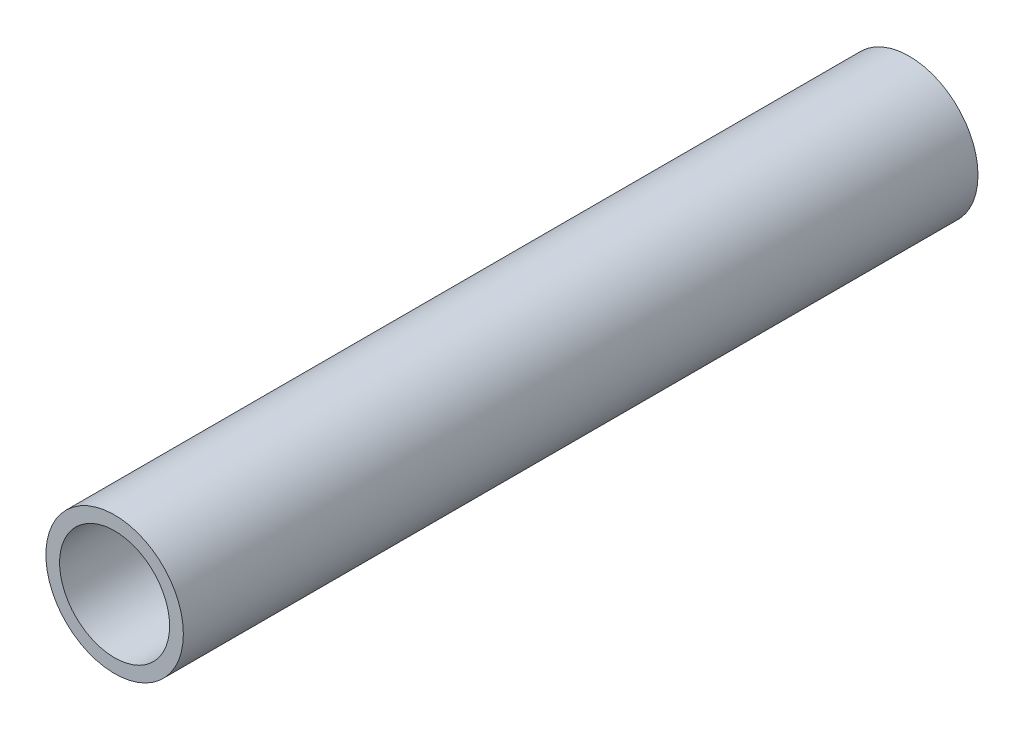
ISO-10303-21;
HEADER;
FILE_DESCRIPTION(('STEP AP214'),'2;1');
FILE_NAME('part.step','',(''),(''),'','','');
FILE_SCHEMA(('AUTOMOTIVE_DESIGN { 1 0 10303 214 1 1 1 1 }'));
ENDSEC;
DATA;
#1=APPLICATION_CONTEXT('core data for automotive mechanical design processes');
#2=APPLICATION_PROTOCOL_DEFINITION('international standard','automotive_design',2000,#1);
#3=PRODUCT_CONTEXT('',#1,'mechanical');
#4=PRODUCT('Part','Part','',(#3));
#5=PRODUCT_RELATED_PRODUCT_CATEGORY('part','',(#4));
#6=PRODUCT_DEFINITION_FORMATION('','',#4);
#7=PRODUCT_DEFINITION_CONTEXT('part definition',#1,'design');
#8=PRODUCT_DEFINITION('design','',#6,#7);
#9=PRODUCT_DEFINITION_SHAPE('','',#8);
#10=(LENGTH_UNIT() NAMED_UNIT(*) SI_UNIT(.MILLI.,.METRE.));
#11=(NAMED_UNIT(*) PLANE_ANGLE_UNIT() SI_UNIT($,.RADIAN.));
#12=(NAMED_UNIT(*) SI_UNIT($,.STERADIAN.) SOLID_ANGLE_UNIT());
#13=UNCERTAINTY_MEASURE_WITH_UNIT(LENGTH_MEASURE(1.E-05),#10,'distance_accuracy_value','');
#14=(GEOMETRIC_REPRESENTATION_CONTEXT(3) GLOBAL_UNCERTAINTY_ASSIGNED_CONTEXT((#13)) GLOBAL_UNIT_ASSIGNED_CONTEXT((#10,
#11,#12)) REPRESENTATION_CONTEXT('',''));
#15=CARTESIAN_POINT('',(0.,0.,0.));
#16=DIRECTION('',(0.,0.,1.));
#17=DIRECTION('',(1.,0.,0.));
#18=AXIS2_PLACEMENT_3D('',#15,#16,#17);
#19=CARTESIAN_POINT('',(0.,0.,14.45));
#20=DIRECTION('',(0.,0.,1.));
#21=DIRECTION('',(1.,0.,0.));
#22=AXIS2_PLACEMENT_3D('',#19,#20,#21);
#23=PLANE('',#22);
#24=CARTESIAN_POINT('',(0.,0.,14.45));
#25=DIRECTION('',(0.,0.,1.));
#26=DIRECTION('',(1.,0.,0.));
#27=AXIS2_PLACEMENT_3D('',#24,#25,#26);
#28=CIRCLE('',#27,1.25);
#29=CARTESIAN_POINT('',(1.25,0.,14.45));
#30=VERTEX_POINT('',#29);
#31=EDGE_CURVE('E10',#30,#30,#28,.T.);
#32=ORIENTED_EDGE('',*,*,#31,.T.);
#33=EDGE_LOOP('',(#32));
#34=FACE_BOUND('',#33,.T.);
#35=CARTESIAN_POINT('',(0.,0.,14.45));
#36=DIRECTION('',(0.,0.,1.));
#37=DIRECTION('',(1.,0.,0.));
#38=AXIS2_PLACEMENT_3D('',#35,#36,#37);
#39=CIRCLE('',#38,1.);
#40=CARTESIAN_POINT('',(1.,0.,14.45));
#41=VERTEX_POINT('',#40);
#42=EDGE_CURVE('E43',#41,#41,#39,.T.);
#43=ORIENTED_EDGE('',*,*,#42,.F.);
#44=EDGE_LOOP('',(#43));
#45=FACE_BOUND('',#44,.T.);
#46=ADVANCED_FACE('F32',(#34,#45),#23,.T.);
#47=CARTESIAN_POINT('',(0.,0.,0.));
#48=DIRECTION('',(0.,0.,1.));
#49=DIRECTION('',(1.,0.,0.));
#50=AXIS2_PLACEMENT_3D('',#47,#48,#49);
#51=PLANE('',#50);
#52=CARTESIAN_POINT('',(0.,0.,0.));
#53=DIRECTION('',(0.,0.,1.));
#54=DIRECTION('',(1.,0.,0.));
#55=AXIS2_PLACEMENT_3D('',#52,#53,#54);
#56=CIRCLE('',#55,1.25);
#57=CARTESIAN_POINT('',(1.25,0.,0.));
#58=VERTEX_POINT('',#57);
#59=EDGE_CURVE('E36',#58,#58,#56,.T.);
#60=ORIENTED_EDGE('',*,*,#59,.F.);
#61=EDGE_LOOP('',(#60));
#62=FACE_BOUND('',#61,.T.);
#63=CARTESIAN_POINT('',(0.,0.,0.));
#64=DIRECTION('',(0.,0.,1.));
#65=DIRECTION('',(1.,0.,0.));
#66=AXIS2_PLACEMENT_3D('',#63,#64,#65);
#67=CIRCLE('',#66,1.);
#68=CARTESIAN_POINT('',(1.,0.,0.));
#69=VERTEX_POINT('',#68);
#70=EDGE_CURVE('E45',#69,#69,#67,.T.);
#71=ORIENTED_EDGE('',*,*,#70,.T.);
#72=EDGE_LOOP('',(#71));
#73=FACE_BOUND('',#72,.T.);
#74=ADVANCED_FACE('F55',(#62,#73),#51,.F.);
#75=CARTESIAN_POINT('',(0.,0.,14.45));
#76=DIRECTION('',(0.,0.,-1.));
#77=DIRECTION('',(-1.,0.,0.));
#78=AXIS2_PLACEMENT_3D('',#75,#76,#77);
#79=CYLINDRICAL_SURFACE('',#78,1.25);
#80=ORIENTED_EDGE('',*,*,#31,.F.);
#81=EDGE_LOOP('',(#80));
#82=FACE_BOUND('',#81,.T.);
#83=ORIENTED_EDGE('',*,*,#59,.T.);
#84=EDGE_LOOP('',(#83));
#85=FACE_BOUND('',#84,.T.);
#86=ADVANCED_FACE('F34',(#82,#85),#79,.T.);
#87=CARTESIAN_POINT('',(0.,0.,14.45));
#88=DIRECTION('',(0.,0.,-1.));
#89=DIRECTION('',(-1.,0.,0.));
#90=AXIS2_PLACEMENT_3D('',#87,#88,#89);
#91=CYLINDRICAL_SURFACE('',#90,1.);
#92=ORIENTED_EDGE('',*,*,#42,.T.);
#93=EDGE_LOOP('',(#92));
#94=FACE_BOUND('',#93,.T.);
#95=ORIENTED_EDGE('',*,*,#70,.F.);
#96=EDGE_LOOP('',(#95));
#97=FACE_BOUND('',#96,.T.);
#98=ADVANCED_FACE('F51',(#94,#97),#91,.F.);
#99=CLOSED_SHELL('',(#46,#74,#86,#98));
#100=MANIFOLD_SOLID_BREP('B2',#99);
#101=ADVANCED_BREP_SHAPE_REPRESENTATION('',(#18,#100),#14);
#102=SHAPE_DEFINITION_REPRESENTATION(#9,#101);
ENDSEC;
END-ISO-10303-21;
